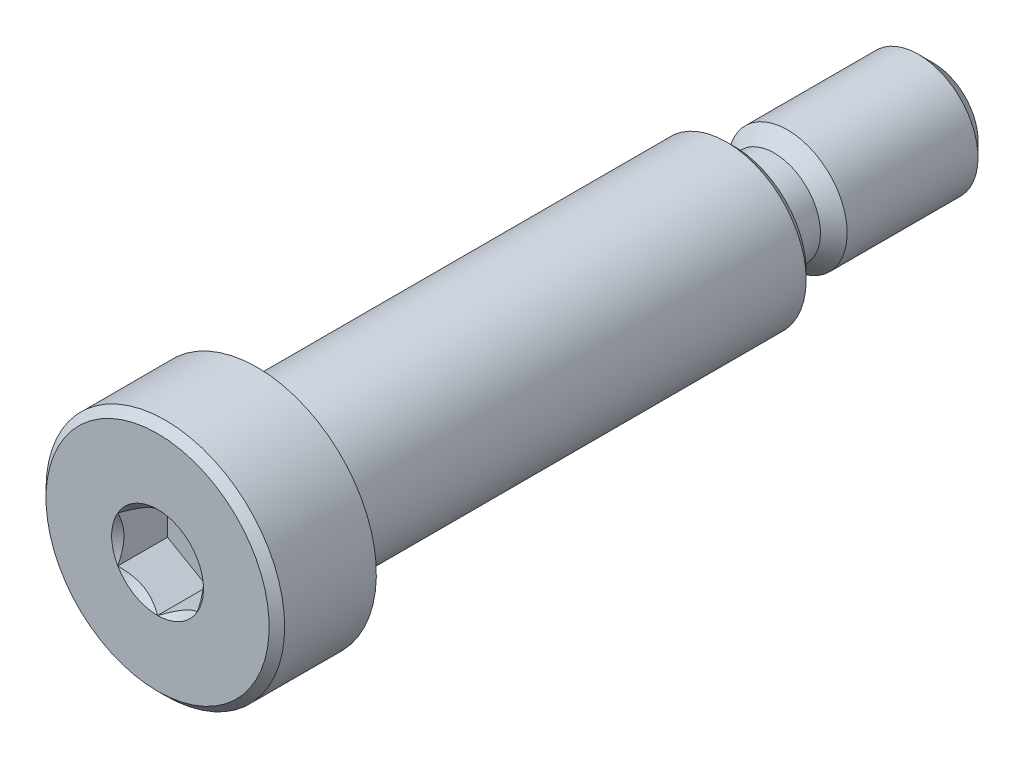
ISO-10303-21;
HEADER;
FILE_DESCRIPTION(('STEP AP214'),'2;1');
FILE_NAME('part.step','',(''),(''),'','','');
FILE_SCHEMA(('AUTOMOTIVE_DESIGN { 1 0 10303 214 1 1 1 1 }'));
ENDSEC;
DATA;
#1=APPLICATION_CONTEXT('core data for automotive mechanical design processes');
#2=APPLICATION_PROTOCOL_DEFINITION('international standard','automotive_design',2000,#1);
#3=PRODUCT_CONTEXT('',#1,'mechanical');
#4=PRODUCT('Part','Part','',(#3));
#5=PRODUCT_RELATED_PRODUCT_CATEGORY('part','',(#4));
#6=PRODUCT_DEFINITION_FORMATION('','',#4);
#7=PRODUCT_DEFINITION_CONTEXT('part definition',#1,'design');
#8=PRODUCT_DEFINITION('design','',#6,#7);
#9=PRODUCT_DEFINITION_SHAPE('','',#8);
#10=(LENGTH_UNIT() NAMED_UNIT(*) SI_UNIT(.MILLI.,.METRE.));
#11=(NAMED_UNIT(*) PLANE_ANGLE_UNIT() SI_UNIT($,.RADIAN.));
#12=(NAMED_UNIT(*) SI_UNIT($,.STERADIAN.) SOLID_ANGLE_UNIT());
#13=UNCERTAINTY_MEASURE_WITH_UNIT(LENGTH_MEASURE(1.E-05),#10,'distance_accuracy_value','');
#14=(GEOMETRIC_REPRESENTATION_CONTEXT(3) GLOBAL_UNCERTAINTY_ASSIGNED_CONTEXT((#13)) GLOBAL_UNIT_ASSIGNED_CONTEXT((#10,
#11,#12)) REPRESENTATION_CONTEXT('',''));
#15=CARTESIAN_POINT('',(0.,0.,0.));
#16=DIRECTION('',(0.,0.,1.));
#17=DIRECTION('',(1.,0.,0.));
#18=AXIS2_PLACEMENT_3D('',#15,#16,#17);
#19=CARTESIAN_POINT('',(0.,0.,0.));
#20=DIRECTION('',(0.,0.,1.));
#21=DIRECTION('',(0.,-1.,0.));
#22=AXIS2_PLACEMENT_3D('',#19,#20,#21);
#23=PLANE('',#22);
#24=CARTESIAN_POINT('',(0.,0.,0.));
#25=DIRECTION('',(0.,0.,1.));
#26=DIRECTION('',(1.,0.,0.));
#27=AXIS2_PLACEMENT_3D('',#24,#25,#26);
#28=CIRCLE('',#27,3.66617420935412);
#29=CARTESIAN_POINT('',(0.,-3.66617420935412,0.));
#30=VERTEX_POINT('',#29);
#31=CARTESIAN_POINT('',(3.175,-1.83308710467707,0.));
#32=VERTEX_POINT('',#31);
#33=EDGE_CURVE('E54',#30,#32,#28,.T.);
#34=ORIENTED_EDGE('',*,*,#33,.F.);
#35=CARTESIAN_POINT('',(-3.175,-1.83308710467706,0.));
#36=VERTEX_POINT('',#35);
#37=EDGE_CURVE('E61',#36,#30,#28,.T.);
#38=ORIENTED_EDGE('',*,*,#37,.F.);
#39=CARTESIAN_POINT('',(-3.175,1.83308710467706,0.));
#40=VERTEX_POINT('',#39);
#41=EDGE_CURVE('E134',#40,#36,#28,.T.);
#42=ORIENTED_EDGE('',*,*,#41,.F.);
#43=CARTESIAN_POINT('',(0.,3.66617420935412,0.));
#44=VERTEX_POINT('',#43);
#45=EDGE_CURVE('E129',#44,#40,#28,.T.);
#46=ORIENTED_EDGE('',*,*,#45,.F.);
#47=CARTESIAN_POINT('',(3.175,1.83308710467706,0.));
#48=VERTEX_POINT('',#47);
#49=EDGE_CURVE('E102',#48,#44,#28,.T.);
#50=ORIENTED_EDGE('',*,*,#49,.F.);
#51=EDGE_CURVE('E93',#32,#48,#28,.T.);
#52=ORIENTED_EDGE('',*,*,#51,.F.);
#53=EDGE_LOOP('',(#34,#38,#42,#46,#50,#52));
#54=FACE_BOUND('',#53,.T.);
#55=CARTESIAN_POINT('',(0.,0.,0.));
#56=DIRECTION('',(0.,0.,1.));
#57=DIRECTION('',(0.,-1.,0.));
#58=AXIS2_PLACEMENT_3D('',#55,#56,#57);
#59=CIRCLE('',#58,8.90587499999999);
#60=CARTESIAN_POINT('',(0.,-8.90587499999999,0.));
#61=VERTEX_POINT('',#60);
#62=EDGE_CURVE('E48',#61,#61,#59,.T.);
#63=ORIENTED_EDGE('',*,*,#62,.T.);
#64=EDGE_LOOP('',(#63));
#65=FACE_BOUND('',#64,.T.);
#66=ADVANCED_FACE('F34',(#54,#65),#23,.T.);
#67=CARTESIAN_POINT('',(0.,0.,-61.9125));
#68=DIRECTION('',(0.,0.,-1.));
#69=DIRECTION('',(0.,1.,0.));
#70=AXIS2_PLACEMENT_3D('',#67,#68,#69);
#71=CYLINDRICAL_SURFACE('',#70,9.525);
#72=CARTESIAN_POINT('',(0.,0.,-0.619125000000019));
#73=DIRECTION('',(0.,0.,1.));
#74=DIRECTION('',(0.,-1.,0.));
#75=AXIS2_PLACEMENT_3D('',#72,#73,#74);
#76=CIRCLE('',#75,9.525);
#77=CARTESIAN_POINT('',(0.,-9.525,-0.619125000000019));
#78=VERTEX_POINT('',#77);
#79=EDGE_CURVE('E226',#78,#78,#76,.F.);
#80=ORIENTED_EDGE('',*,*,#79,.T.);
#81=EDGE_LOOP('',(#80));
#82=FACE_BOUND('',#81,.T.);
#83=CARTESIAN_POINT('',(0.,0.,-7.93750000000001));
#84=DIRECTION('',(0.,0.,-1.));
#85=DIRECTION('',(0.,1.,0.));
#86=AXIS2_PLACEMENT_3D('',#83,#84,#85);
#87=CIRCLE('',#86,9.525);
#88=CARTESIAN_POINT('',(0.,9.525,-7.93750000000001));
#89=VERTEX_POINT('',#88);
#90=EDGE_CURVE('E241',#89,#89,#87,.T.);
#91=ORIENTED_EDGE('',*,*,#90,.F.);
#92=EDGE_LOOP('',(#91));
#93=FACE_BOUND('',#92,.T.);
#94=ADVANCED_FACE('F195',(#82,#93),#71,.T.);
#95=CARTESIAN_POINT('',(0.,-9.525,-7.93750000000001));
#96=DIRECTION('',(0.,0.,-1.));
#97=DIRECTION('',(0.,1.,0.));
#98=AXIS2_PLACEMENT_3D('',#95,#96,#97);
#99=PLANE('',#98);
#100=ORIENTED_EDGE('',*,*,#90,.T.);
#101=EDGE_LOOP('',(#100));
#102=FACE_BOUND('',#101,.T.);
#103=CARTESIAN_POINT('',(0.,0.,-7.93750000000001));
#104=DIRECTION('',(0.,0.,-1.));
#105=DIRECTION('',(0.,1.,0.));
#106=AXIS2_PLACEMENT_3D('',#103,#104,#105);
#107=CIRCLE('',#106,6.34999999999999);
#108=CARTESIAN_POINT('',(0.,6.34999999999999,-7.93750000000001));
#109=VERTEX_POINT('',#108);
#110=EDGE_CURVE('E243',#109,#109,#107,.T.);
#111=ORIENTED_EDGE('',*,*,#110,.F.);
#112=EDGE_LOOP('',(#111));
#113=FACE_BOUND('',#112,.T.);
#114=ADVANCED_FACE('F200',(#102,#113),#99,.T.);
#115=CARTESIAN_POINT('',(0.,0.,-61.9125));
#116=DIRECTION('',(0.,0.,-1.));
#117=DIRECTION('',(0.,1.,0.));
#118=AXIS2_PLACEMENT_3D('',#115,#116,#117);
#119=CYLINDRICAL_SURFACE('',#118,6.35);
#120=CARTESIAN_POINT('',(0.,0.,-45.418375));
#121=DIRECTION('',(0.,0.,-1.));
#122=DIRECTION('',(0.,1.,0.));
#123=AXIS2_PLACEMENT_3D('',#120,#121,#122);
#124=CIRCLE('',#123,6.35);
#125=CARTESIAN_POINT('',(0.,-6.34999999999999,-45.418375));
#126=VERTEX_POINT('',#125);
#127=EDGE_CURVE('E219',#126,#126,#124,.F.);
#128=ORIENTED_EDGE('',*,*,#127,.T.);
#129=EDGE_LOOP('',(#128));
#130=FACE_BOUND('',#129,.T.);
#131=ORIENTED_EDGE('',*,*,#110,.T.);
#132=EDGE_LOOP('',(#131));
#133=FACE_BOUND('',#132,.T.);
#134=ADVANCED_FACE('F344',(#130,#133),#119,.T.);
#135=CARTESIAN_POINT('',(0.,-6.35,-46.0375));
#136=DIRECTION('',(0.,0.,-1.));
#137=DIRECTION('',(0.,1.,0.));
#138=AXIS2_PLACEMENT_3D('',#135,#136,#137);
#139=PLANE('',#138);
#140=CARTESIAN_POINT('',(0.,0.,-46.0375));
#141=DIRECTION('',(0.,0.,-1.));
#142=DIRECTION('',(0.,1.,0.));
#143=AXIS2_PLACEMENT_3D('',#140,#141,#142);
#144=CIRCLE('',#143,5.73087499999999);
#145=CARTESIAN_POINT('',(0.,-5.73087499999998,-46.0375));
#146=VERTEX_POINT('',#145);
#147=EDGE_CURVE('E222',#146,#146,#144,.T.);
#148=ORIENTED_EDGE('',*,*,#147,.T.);
#149=EDGE_LOOP('',(#148));
#150=FACE_BOUND('',#149,.T.);
#151=CARTESIAN_POINT('',(0.,0.,-46.0375));
#152=DIRECTION('',(0.,0.,-1.));
#153=DIRECTION('',(0.,1.,0.));
#154=AXIS2_PLACEMENT_3D('',#151,#152,#153);
#155=CIRCLE('',#154,4.7625);
#156=CARTESIAN_POINT('',(0.,4.7625,-46.0375));
#157=VERTEX_POINT('',#156);
#158=EDGE_CURVE('E252',#157,#157,#155,.T.);
#159=ORIENTED_EDGE('',*,*,#158,.F.);
#160=EDGE_LOOP('',(#159));
#161=FACE_BOUND('',#160,.T.);
#162=ADVANCED_FACE('F351',(#150,#161),#139,.T.);
#163=CARTESIAN_POINT('',(0.,0.,-47.1043));
#164=DIRECTION('',(0.,0.,-1.));
#165=DIRECTION('',(0.,1.,0.));
#166=AXIS2_PLACEMENT_3D('',#163,#164,#165);
#167=TOROIDAL_SURFACE('',#166,4.7625,1.0668);
#168=CARTESIAN_POINT('',(0.,0.,-47.1043));
#169=DIRECTION('',(0.,0.,-1.));
#170=DIRECTION('',(0.,1.,0.));
#171=AXIS2_PLACEMENT_3D('',#168,#169,#170);
#172=CIRCLE('',#171,3.6957);
#173=CARTESIAN_POINT('',(0.,3.6957,-47.1043));
#174=VERTEX_POINT('',#173);
#175=EDGE_CURVE('E256',#174,#174,#172,.T.);
#176=ORIENTED_EDGE('',*,*,#175,.F.);
#177=EDGE_LOOP('',(#176));
#178=FACE_BOUND('',#177,.T.);
#179=ORIENTED_EDGE('',*,*,#158,.T.);
#180=EDGE_LOOP('',(#179));
#181=FACE_BOUND('',#180,.T.);
#182=ADVANCED_FACE('F359',(#178,#181),#167,.F.);
#183=CARTESIAN_POINT('',(0.,0.,-61.9125));
#184=DIRECTION('',(0.,0.,-1.));
#185=DIRECTION('',(0.,1.,0.));
#186=AXIS2_PLACEMENT_3D('',#183,#184,#185);
#187=CYLINDRICAL_SURFACE('',#186,3.6957);
#188=CARTESIAN_POINT('',(0.,0.,-49.2125));
#189=DIRECTION('',(0.,0.,-1.));
#190=DIRECTION('',(0.,1.,0.));
#191=AXIS2_PLACEMENT_3D('',#188,#189,#190);
#192=CIRCLE('',#191,3.6957);
#193=CARTESIAN_POINT('',(0.,3.6957,-49.2125));
#194=VERTEX_POINT('',#193);
#195=EDGE_CURVE('E260',#194,#194,#192,.T.);
#196=ORIENTED_EDGE('',*,*,#195,.F.);
#197=EDGE_LOOP('',(#196));
#198=FACE_BOUND('',#197,.T.);
#199=ORIENTED_EDGE('',*,*,#175,.T.);
#200=EDGE_LOOP('',(#199));
#201=FACE_BOUND('',#200,.T.);
#202=ADVANCED_FACE('F385',(#198,#201),#187,.T.);
#203=CARTESIAN_POINT('',(0.,0.,-49.2125));
#204=DIRECTION('',(0.,0.,-1.));
#205=DIRECTION('',(0.,1.,0.));
#206=AXIS2_PLACEMENT_3D('',#203,#204,#205);
#207=CONICAL_SURFACE('',#206,3.6957,0.785398163397443);
#208=CARTESIAN_POINT('',(0.,0.,-50.2793));
#209=DIRECTION('',(0.,0.,-1.));
#210=DIRECTION('',(0.,1.,0.));
#211=AXIS2_PLACEMENT_3D('',#208,#209,#210);
#212=CIRCLE('',#211,4.7625);
#213=CARTESIAN_POINT('',(0.,4.7625,-50.2793));
#214=VERTEX_POINT('',#213);
#215=EDGE_CURVE('E247',#214,#214,#212,.F.);
#216=ORIENTED_EDGE('',*,*,#215,.T.);
#217=EDGE_LOOP('',(#216));
#218=FACE_BOUND('',#217,.T.);
#219=ORIENTED_EDGE('',*,*,#195,.T.);
#220=EDGE_LOOP('',(#219));
#221=FACE_BOUND('',#220,.T.);
#222=ADVANCED_FACE('F376',(#218,#221),#207,.T.);
#223=CARTESIAN_POINT('',(0.,-4.7625,-61.9125));
#224=DIRECTION('',(0.,0.,-1.));
#225=DIRECTION('',(0.,1.,0.));
#226=AXIS2_PLACEMENT_3D('',#223,#224,#225);
#227=PLANE('',#226);
#228=CARTESIAN_POINT('',(0.,0.,-61.9125));
#229=DIRECTION('',(0.,0.,-1.));
#230=DIRECTION('',(0.,1.,0.));
#231=AXIS2_PLACEMENT_3D('',#228,#229,#230);
#232=CIRCLE('',#231,3.57187500000002);
#233=CARTESIAN_POINT('',(0.,3.57187500000002,-61.9125));
#234=VERTEX_POINT('',#233);
#235=EDGE_CURVE('E229',#234,#234,#232,.T.);
#236=ORIENTED_EDGE('',*,*,#235,.T.);
#237=EDGE_LOOP('',(#236));
#238=FACE_BOUND('',#237,.T.);
#239=ADVANCED_FACE('F367',(#238),#227,.T.);
#240=CARTESIAN_POINT('',(0.,0.,-61.9125));
#241=DIRECTION('',(0.,0.,-1.));
#242=DIRECTION('',(0.,1.,0.));
#243=AXIS2_PLACEMENT_3D('',#240,#241,#242);
#244=CYLINDRICAL_SURFACE('',#243,4.7625);
#245=CARTESIAN_POINT('',(0.,0.,-60.721875));
#246=DIRECTION('',(0.,0.,-1.));
#247=DIRECTION('',(0.,1.,0.));
#248=AXIS2_PLACEMENT_3D('',#245,#246,#247);
#249=CIRCLE('',#248,4.7625);
#250=CARTESIAN_POINT('',(0.,4.7625,-60.721875));
#251=VERTEX_POINT('',#250);
#252=EDGE_CURVE('E224',#251,#251,#249,.F.);
#253=ORIENTED_EDGE('',*,*,#252,.T.);
#254=EDGE_LOOP('',(#253));
#255=FACE_BOUND('',#254,.T.);
#256=ORIENTED_EDGE('',*,*,#215,.F.);
#257=EDGE_LOOP('',(#256));
#258=FACE_BOUND('',#257,.T.);
#259=ADVANCED_FACE('F208',(#255,#258),#244,.T.);
#260=CARTESIAN_POINT('',(0.,0.,-61.9125));
#261=DIRECTION('',(0.,0.,1.));
#262=DIRECTION('',(0.,-1.,0.));
#263=AXIS2_PLACEMENT_3D('',#260,#261,#262);
#264=CONICAL_SURFACE('',#263,3.57187500000002,0.785398163397442);
#265=ORIENTED_EDGE('',*,*,#252,.F.);
#266=EDGE_LOOP('',(#265));
#267=FACE_BOUND('',#266,.T.);
#268=ORIENTED_EDGE('',*,*,#235,.F.);
#269=EDGE_LOOP('',(#268));
#270=FACE_BOUND('',#269,.T.);
#271=ADVANCED_FACE('F205',(#267,#270),#264,.T.);
#272=CARTESIAN_POINT('',(0.,0.,-46.0375));
#273=DIRECTION('',(0.,0.,1.));
#274=DIRECTION('',(0.,-1.,0.));
#275=AXIS2_PLACEMENT_3D('',#272,#273,#274);
#276=CONICAL_SURFACE('',#275,5.73087499999999,0.78539816339745);
#277=CARTESIAN_POINT('',(0.,-6.34999999999999,-45.418375));
#278=CARTESIAN_POINT('',(0.,-6.34355078124999,-45.42482421875));
#279=CARTESIAN_POINT('',(0.,-6.33710156249999,-45.4312734375));
#280=CARTESIAN_POINT('',(0.,-6.32420312499999,-45.444171875));
#281=CARTESIAN_POINT('',(0.,-6.31775390624999,-45.45062109375));
#282=CARTESIAN_POINT('',(0.,-6.30485546874999,-45.46351953125));
#283=CARTESIAN_POINT('',(0.,-6.29840624999999,-45.46996875));
#284=CARTESIAN_POINT('',(0.,-6.28550781249999,-45.4828671875));
#285=CARTESIAN_POINT('',(0.,-6.27905859374999,-45.48931640625));
#286=CARTESIAN_POINT('',(0.,-6.26616015624999,-45.50221484375));
#287=CARTESIAN_POINT('',(0.,-6.25971093749999,-45.5086640625));
#288=CARTESIAN_POINT('',(0.,-6.24681249999999,-45.5215625));
#289=CARTESIAN_POINT('',(0.,-6.24036328124999,-45.52801171875));
#290=CARTESIAN_POINT('',(0.,-6.22746484374999,-45.54091015625));
#291=CARTESIAN_POINT('',(0.,-6.22101562499999,-45.547359375));
#292=CARTESIAN_POINT('',(0.,-6.20811718749999,-45.5602578125));
#293=CARTESIAN_POINT('',(0.,-6.20166796874999,-45.56670703125));
#294=CARTESIAN_POINT('',(0.,-6.18876953124999,-45.57960546875));
#295=CARTESIAN_POINT('',(0.,-6.18232031249999,-45.5860546875));
#296=CARTESIAN_POINT('',(0.,-6.16942187499999,-45.598953125));
#297=CARTESIAN_POINT('',(0.,-6.16297265624999,-45.60540234375));
#298=CARTESIAN_POINT('',(0.,-6.15007421874999,-45.61830078125));
#299=CARTESIAN_POINT('',(0.,-6.14362499999999,-45.62475));
#300=CARTESIAN_POINT('',(0.,-6.13072656249999,-45.6376484375));
#301=CARTESIAN_POINT('',(0.,-6.12427734374999,-45.64409765625));
#302=CARTESIAN_POINT('',(0.,-6.11137890624999,-45.65699609375));
#303=CARTESIAN_POINT('',(0.,-6.10492968749999,-45.6634453125));
#304=CARTESIAN_POINT('',(0.,-6.09203124999999,-45.67634375));
#305=CARTESIAN_POINT('',(0.,-6.08558203124999,-45.68279296875));
#306=CARTESIAN_POINT('',(0.,-6.07268359374999,-45.69569140625));
#307=CARTESIAN_POINT('',(0.,-6.06623437499999,-45.702140625));
#308=CARTESIAN_POINT('',(0.,-6.05333593749999,-45.7150390625));
#309=CARTESIAN_POINT('',(0.,-6.04688671874999,-45.72148828125));
#310=CARTESIAN_POINT('',(0.,-6.03398828124999,-45.73438671875));
#311=CARTESIAN_POINT('',(0.,-6.02753906249999,-45.7408359375));
#312=CARTESIAN_POINT('',(0.,-6.01464062499999,-45.753734375));
#313=CARTESIAN_POINT('',(0.,-6.00819140624999,-45.76018359375));
#314=CARTESIAN_POINT('',(0.,-5.99529296874999,-45.77308203125));
#315=CARTESIAN_POINT('',(0.,-5.98884374999998,-45.77953125));
#316=CARTESIAN_POINT('',(0.,-5.97594531249998,-45.7924296875));
#317=CARTESIAN_POINT('',(0.,-5.96949609374999,-45.79887890625));
#318=CARTESIAN_POINT('',(0.,-5.95659765624999,-45.81177734375));
#319=CARTESIAN_POINT('',(0.,-5.95014843749999,-45.8182265625));
#320=CARTESIAN_POINT('',(0.,-5.93724999999999,-45.831125));
#321=CARTESIAN_POINT('',(0.,-5.93080078124999,-45.83757421875));
#322=CARTESIAN_POINT('',(0.,-5.91790234374998,-45.85047265625));
#323=CARTESIAN_POINT('',(0.,-5.91145312499998,-45.856921875));
#324=CARTESIAN_POINT('',(0.,-5.89855468749998,-45.8698203125));
#325=CARTESIAN_POINT('',(0.,-5.89210546874998,-45.87626953125));
#326=CARTESIAN_POINT('',(0.,-5.87920703124998,-45.88916796875));
#327=CARTESIAN_POINT('',(0.,-5.87275781249998,-45.8956171875));
#328=CARTESIAN_POINT('',(0.,-5.85985937499998,-45.908515625));
#329=CARTESIAN_POINT('',(0.,-5.85341015624998,-45.91496484375));
#330=CARTESIAN_POINT('',(0.,-5.84051171874998,-45.92786328125));
#331=CARTESIAN_POINT('',(0.,-5.83406249999998,-45.9343125));
#332=CARTESIAN_POINT('',(0.,-5.82116406249998,-45.9472109375));
#333=CARTESIAN_POINT('',(0.,-5.81471484374998,-45.95366015625));
#334=CARTESIAN_POINT('',(0.,-5.80181640624998,-45.96655859375));
#335=CARTESIAN_POINT('',(0.,-5.79536718749998,-45.9730078125));
#336=CARTESIAN_POINT('',(0.,-5.78246874999998,-45.98590625));
#337=CARTESIAN_POINT('',(0.,-5.77601953124998,-45.99235546875));
#338=CARTESIAN_POINT('',(0.,-5.76312109374998,-46.00525390625));
#339=CARTESIAN_POINT('',(0.,-5.75667187499998,-46.011703125));
#340=CARTESIAN_POINT('',(0.,-5.74377343749998,-46.0246015625));
#341=CARTESIAN_POINT('',(0.,-5.73732421874998,-46.03105078125));
#342=CARTESIAN_POINT('',(0.,-5.73087499999998,-46.0375));
#343=B_SPLINE_CURVE_WITH_KNOTS('',3,(#277,#278,#279,#280,#281,#282,#283,#284,#285,#286,#287,
#288,#289,#290,#291,#292,#293,#294,#295,#296,#297,#298,#299,#300,#301,#302,#303,#304,#305,#306,
#307,#308,#309,#310,#311,#312,#313,#314,#315,#316,#317,#318,#319,#320,#321,#322,#323,#324,#325,
#326,#327,#328,#329,#330,#331,#332,#333,#334,#335,#336,#337,#338,#339,#340,#341,#342),
.UNSPECIFIED.,.F.,.F.,(4,2,2,2,2,2,2,2,2,2,2,2,2,2,2,2,2,2,2,2,2,2,2,2,2,2,2,2,2,2,2,2,4),(0.,
0.0273617178688837,0.0547234357377674,0.0820851536066518,0.109446871475536,0.136808589344414,
0.164170307213299,0.191532025082182,0.218893742951066,0.24625546081995,0.273617178688829,
0.300978896557713,0.328340614426597,0.355702332295481,0.38306405016436,0.410425768033244,
0.437787485902128,0.465149203771012,0.492510921639895,0.519872639508775,0.547234357377659,
0.574596075246542,0.601957793115427,0.629319510984305,0.656681228853189,0.684042946722074,
0.711404664590957,0.738766382459841,0.76612810032872,0.793489818197604,0.820851536066488,
0.848213253935372,0.875574971804251),.UNSPECIFIED.);
#344=EDGE_CURVE('BSEAM207',#126,#146,#343,.T.);
#345=ORIENTED_EDGE('',*,*,#127,.F.);
#346=ORIENTED_EDGE('',*,*,#147,.F.);
#347=ORIENTED_EDGE('',*,*,#344,.T.);
#348=ORIENTED_EDGE('',*,*,#344,.F.);
#349=EDGE_LOOP('',(#345,#347,#346,#348));
#350=FACE_BOUND('',#349,.T.);
#351=ADVANCED_FACE('F207',(#350),#276,.T.);
#352=CARTESIAN_POINT('',(0.,0.,-0.619125000000019));
#353=DIRECTION('',(0.,0.,-1.));
#354=DIRECTION('',(0.,1.,0.));
#355=AXIS2_PLACEMENT_3D('',#352,#353,#354);
#356=CONICAL_SURFACE('',#355,9.525,0.785398163397443);
#357=ORIENTED_EDGE('',*,*,#62,.F.);
#358=EDGE_LOOP('',(#357));
#359=FACE_BOUND('',#358,.T.);
#360=ORIENTED_EDGE('',*,*,#79,.F.);
#361=EDGE_LOOP('',(#360));
#362=FACE_BOUND('',#361,.T.);
#363=ADVANCED_FACE('F36',(#359,#362),#356,.T.);
#364=CARTESIAN_POINT('',(0.,0.,0.));
#365=DIRECTION('',(0.,0.,1.));
#366=DIRECTION('',(1.,0.,0.));
#367=AXIS2_PLACEMENT_3D('',#364,#365,#366);
#368=CONICAL_SURFACE('',#367,3.66617420935412,0.78539816339745);
#369=ORIENTED_EDGE('',*,*,#49,.T.);
#370=CARTESIAN_POINT('',(3.1752,1.83297163462322,0.000115475508944067));
#371=CARTESIAN_POINT('',(3.06606165005017,1.89598269034567,-0.0628410163082169));
#372=CARTESIAN_POINT('',(2.95509837192206,1.9600473688431,-0.122099895765255));
#373=CARTESIAN_POINT('',(2.72883215365405,2.09068223086865,-0.230601344269443));
#374=CARTESIAN_POINT('',(2.61350769674774,2.15726483710766,-0.279783546061288));
#375=CARTESIAN_POINT('',(2.38096147751938,2.29152545937818,-0.364033541125997));
#376=CARTESIAN_POINT('',(2.26379893371885,2.35916928558036,-0.399313085500551));
#377=CARTESIAN_POINT('',(2.02689455535372,2.49594609220167,-0.45366842986518));
#378=CARTESIAN_POINT('',(1.90715995735645,2.5650748945867,-0.47278480247036));
#379=CARTESIAN_POINT('',(1.70080208124842,2.68421566990707,-0.490032869376752));
#380=CARTESIAN_POINT('',(1.61444529227085,2.73407378526963,-0.492586066386179));
#381=CARTESIAN_POINT('',(1.44187218347529,2.83370891608763,-0.488283726876735));
#382=CARTESIAN_POINT('',(1.3556559235072,2.88348589698873,-0.481424891978556));
#383=CARTESIAN_POINT('',(1.18404020841287,2.98256827629561,-0.4586901166963));
#384=CARTESIAN_POINT('',(1.09864177574673,3.03187308438378,-0.442804090312722));
#385=CARTESIAN_POINT('',(0.929311596694528,3.1296359088415,-0.402882016002049));
#386=CARTESIAN_POINT('',(0.845379738380253,3.17809398983283,-0.37884659291483));
#387=CARTESIAN_POINT('',(0.696376420715886,3.2641210953965,-0.329394765582835));
#388=CARTESIAN_POINT('',(0.630975148808269,3.30188053733771,-0.305278280699013));
#389=CARTESIAN_POINT('',(0.501346749794894,3.3767215284027,-0.253158532862845));
#390=CARTESIAN_POINT('',(0.437119658558277,3.41380305681743,-0.225155151396475));
#391=CARTESIAN_POINT('',(0.3100419654874,3.48717139711989,-0.165889434455491));
#392=CARTESIAN_POINT('',(0.247187749251276,3.52346029578352,-0.134637346645791));
#393=CARTESIAN_POINT('',(0.122643379151907,3.59536602138644,-0.0692846556080675));
#394=CARTESIAN_POINT('',(0.0609525390212909,3.63098324454239,-0.0351858004814551));
#395=CARTESIAN_POINT('',(-0.000199999999999575,3.66628967940796,0.000115475508943787));
#396=B_SPLINE_CURVE_WITH_KNOTS('',3,(#370,#371,#372,#373,#374,#375,#376,#377,#378,#379,#380,
#381,#382,#383,#384,#385,#386,#387,#388,#389,#390,#391,#392,#393,#394,#395),.UNSPECIFIED.,.F.,
.F.,(4,2,2,2,2,2,2,2,2,2,2,2,4),(0.,0.422910572436808,0.848285055427807,1.26690402276127,
1.68446903107506,1.98329272958351,2.2822211754689,2.58148426995465,2.88072442418452,
3.11844134429546,3.35616551414405,3.59316134346767,3.8300126974443),.UNSPECIFIED.);
#397=EDGE_CURVE('E11',#48,#44,#396,.T.);
#398=ORIENTED_EDGE('',*,*,#397,.F.);
#399=EDGE_LOOP('',(#369,#398));
#400=FACE_BOUND('',#399,.T.);
#401=ADVANCED_FACE('F105',(#400),#368,.F.);
#402=ORIENTED_EDGE('',*,*,#45,.T.);
#403=CARTESIAN_POINT('',(0.000200000000000467,3.66628967940796,0.000115475508943935));
#404=CARTESIAN_POINT('',(-0.108938349949825,3.60327862368552,-0.0628410163082174));
#405=CARTESIAN_POINT('',(-0.219901628077944,3.53921394518809,-0.122099895765256));
#406=CARTESIAN_POINT('',(-0.446167846345946,3.40857908316254,-0.230601344269443));
#407=CARTESIAN_POINT('',(-0.561492303252261,3.34199647692353,-0.279783546061287));
#408=CARTESIAN_POINT('',(-0.794038522480624,3.207735854653,-0.364033541125996));
#409=CARTESIAN_POINT('',(-0.911201066281148,3.14009202845083,-0.39931308550055));
#410=CARTESIAN_POINT('',(-1.14810544464628,3.00331522182952,-0.453668429865179));
#411=CARTESIAN_POINT('',(-1.26784004264355,2.93418641944448,-0.47278480247036));
#412=CARTESIAN_POINT('',(-1.47419791875158,2.81504564412411,-0.490032869376752));
#413=CARTESIAN_POINT('',(-1.56055470772915,2.76518752876156,-0.492586066386179));
#414=CARTESIAN_POINT('',(-1.73312781652471,2.66555239794355,-0.488283726876735));
#415=CARTESIAN_POINT('',(-1.8193440764928,2.61577541704245,-0.481424891978555));
#416=CARTESIAN_POINT('',(-1.99095979158713,2.51669303773558,-0.458690116696299));
#417=CARTESIAN_POINT('',(-2.07635822425327,2.4673882296474,-0.442804090312722));
#418=CARTESIAN_POINT('',(-2.24568840330547,2.36962540518969,-0.402882016002048));
#419=CARTESIAN_POINT('',(-2.32962026161975,2.32116732419836,-0.37884659291483));
#420=CARTESIAN_POINT('',(-2.47862357928411,2.23514021863469,-0.329394765582835));
#421=CARTESIAN_POINT('',(-2.54402485119173,2.19738077669348,-0.305278280699012));
#422=CARTESIAN_POINT('',(-2.67365325020511,2.12253978562849,-0.253158532862845));
#423=CARTESIAN_POINT('',(-2.73788034144172,2.08545825721376,-0.225155151396475));
#424=CARTESIAN_POINT('',(-2.8649580345126,2.01208991691129,-0.165889434455491));
#425=CARTESIAN_POINT('',(-2.92781225074872,1.97580101824767,-0.134637346645791));
#426=CARTESIAN_POINT('',(-3.05235662084809,1.90389529264474,-0.0692846556080678));
#427=CARTESIAN_POINT('',(-3.11404746097871,1.8682780694888,-0.0351858004814554));
#428=CARTESIAN_POINT('',(-3.1752,1.83297163462323,0.000115475508943606));
#429=B_SPLINE_CURVE_WITH_KNOTS('',3,(#403,#404,#405,#406,#407,#408,#409,#410,#411,#412,#413,
#414,#415,#416,#417,#418,#419,#420,#421,#422,#423,#424,#425,#426,#427,#428),.UNSPECIFIED.,.F.,
.F.,(4,2,2,2,2,2,2,2,2,2,2,2,4),(0.,0.422910572436808,0.848285055427807,1.26690402276127,
1.68446903107506,1.98329272958351,2.2822211754689,2.58148426995465,2.88072442418451,
3.11844134429546,3.35616551414405,3.59316134346766,3.8300126974443),.UNSPECIFIED.);
#430=EDGE_CURVE('E130',#44,#40,#429,.T.);
#431=ORIENTED_EDGE('',*,*,#430,.F.);
#432=EDGE_LOOP('',(#402,#431));
#433=FACE_BOUND('',#432,.T.);
#434=ADVANCED_FACE('F297',(#433),#368,.F.);
#435=ORIENTED_EDGE('',*,*,#41,.T.);
#436=CARTESIAN_POINT('',(-3.175,-3.65592387452516,1.17597452610651));
#437=CARTESIAN_POINT('',(-3.175,-3.56690614739902,1.10877955728795));
#438=CARTESIAN_POINT('',(-3.175,-3.47739001482927,1.04223411677949));
#439=CARTESIAN_POINT('',(-3.175,-3.29716433407819,0.910733107989));
#440=CARTESIAN_POINT('',(-3.175,-3.20645449195236,0.8457779430093));
#441=CARTESIAN_POINT('',(-3.175,-3.02298124672425,0.717286472588262));
#442=CARTESIAN_POINT('',(-3.175,-2.93020737789476,0.653765060519482));
#443=CARTESIAN_POINT('',(-3.175,-2.74308490461527,0.529093231239513));
#444=CARTESIAN_POINT('',(-3.175,-2.64873641209623,0.467942646518007));
#445=CARTESIAN_POINT('',(-3.175,-2.45276910629102,0.345127291468585));
#446=CARTESIAN_POINT('',(-3.175,-2.35104296923552,0.283632900035067));
#447=CARTESIAN_POINT('',(-3.175,-2.14521620329061,0.164690024110211));
#448=CARTESIAN_POINT('',(-3.175,-2.04111520164361,0.107242180628362));
#449=CARTESIAN_POINT('',(-3.175,-1.8305483898592,-0.00236807378855735));
#450=CARTESIAN_POINT('',(-3.175,-1.72409073387149,-0.05454602658689));
#451=CARTESIAN_POINT('',(-3.175,-1.50827203793058,-0.152448430174923));
#452=CARTESIAN_POINT('',(-3.175,-1.39891233941784,-0.198175803007057));
#453=CARTESIAN_POINT('',(-3.175,-1.18604701054559,-0.278193824629251));
#454=CARTESIAN_POINT('',(-3.175,-1.08277848917347,-0.313108695034414));
#455=CARTESIAN_POINT('',(-3.175,-0.873755153890324,-0.374653665073786));
#456=CARTESIAN_POINT('',(-3.175,-0.768000169236097,-0.401283193963396));
#457=CARTESIAN_POINT('',(-3.175,-0.556394353071963,-0.444423804951883));
#458=CARTESIAN_POINT('',(-3.175,-0.450579451492892,-0.461108250420231));
#459=CARTESIAN_POINT('',(-3.175,-0.237818454981045,-0.484034858218018));
#460=CARTESIAN_POINT('',(-3.175,-0.130872557680108,-0.49027881555587));
#461=CARTESIAN_POINT('',(-3.175,0.0792250150830045,-0.491860727197653));
#462=CARTESIAN_POINT('',(-3.175,0.18237391199382,-0.487585251998013));
#463=CARTESIAN_POINT('',(-3.175,0.387788153537299,-0.469217325011947));
#464=CARTESIAN_POINT('',(-3.175,0.490053411359905,-0.455123919552885));
#465=CARTESIAN_POINT('',(-3.175,0.694689208906974,-0.417649304806497));
#466=CARTESIAN_POINT('',(-3.175,0.797030337701614,-0.394110040645698));
#467=CARTESIAN_POINT('',(-3.175,0.999482692253839,-0.3389990990408));
#468=CARTESIAN_POINT('',(-3.175,1.09959410383402,-0.307428093699382));
#469=CARTESIAN_POINT('',(-3.175,1.30666025401972,-0.234302973381313));
#470=CARTESIAN_POINT('',(-3.175,1.41338058113121,-0.192091761298271));
#471=CARTESIAN_POINT('',(-3.175,1.62403512608011,-0.101194633675295));
#472=CARTESIAN_POINT('',(-3.175,1.72796839622315,-0.0525065484982067));
#473=CARTESIAN_POINT('',(-3.175,1.93357808805447,0.0501937756761229));
#474=CARTESIAN_POINT('',(-3.175,2.03524592560239,0.104223062169345));
#475=CARTESIAN_POINT('',(-3.175,2.23624195707291,0.216408901364748));
#476=CARTESIAN_POINT('',(-3.175,2.3355705197654,0.274564797656881));
#477=CARTESIAN_POINT('',(-3.175,2.52730642275902,0.391215115503931));
#478=CARTESIAN_POINT('',(-3.175,2.61981218330511,0.449548619193316));
#479=CARTESIAN_POINT('',(-3.175,2.80323560367684,0.568668649469825));
#480=CARTESIAN_POINT('',(-3.175,2.89415314246283,0.629455361859399));
#481=CARTESIAN_POINT('',(-3.175,3.07387072487129,0.752541216482857));
#482=CARTESIAN_POINT('',(-3.175,3.16268196996071,0.814824062049374));
#483=CARTESIAN_POINT('',(-3.175,3.33909075370388,0.941036832486232));
#484=CARTESIAN_POINT('',(-3.175,3.42668861940902,1.00496629970184));
#485=CARTESIAN_POINT('',(-3.175,3.51377838474595,1.06956897805668));
#486=B_SPLINE_CURVE_WITH_KNOTS('',3,(#436,#437,#438,#439,#440,#441,#442,#443,#444,#445,#446,
#447,#448,#449,#450,#451,#452,#453,#454,#455,#456,#457,#458,#459,#460,#461,#462,#463,#464,#465,
#466,#467,#468,#469,#470,#471,#472,#473,#474,#475,#476,#477,#478,#479,#480,#481,#482,#483,#484,
#485),.UNSPECIFIED.,.F.,.F.,(4,2,2,2,2,2,2,2,2,2,2,2,2,2,2,2,2,2,2,2,2,2,2,2,4),(0.,
0.334601712013315,0.669287419770511,1.00656636796479,1.3438214421939,1.70035269072413,
2.05694029057745,2.41244349871029,2.76778514705124,3.09453137075717,3.42130009774479,
3.74219200698696,4.06302874036785,4.37225254917033,4.68150639886781,4.99616636831742,
5.31080001541914,5.65482708645254,5.99896969199844,6.34424851858142,6.68947254507109,
7.01751396994993,7.34558028700741,7.67098168170701,7.99629359145139),.UNSPECIFIED.);
#487=EDGE_CURVE('E132',#40,#36,#486,.F.);
#488=ORIENTED_EDGE('',*,*,#487,.F.);
#489=EDGE_LOOP('',(#435,#488));
#490=FACE_BOUND('',#489,.T.);
#491=ADVANCED_FACE('F294',(#490),#368,.F.);
#492=ORIENTED_EDGE('',*,*,#37,.T.);
#493=CARTESIAN_POINT('',(-3.1752,-1.83297163462322,0.000115475508942766));
#494=CARTESIAN_POINT('',(-3.06606165005017,-1.89598269034567,-0.0628410163082177));
#495=CARTESIAN_POINT('',(-2.95509837192205,-1.9600473688431,-0.122099895765256));
#496=CARTESIAN_POINT('',(-2.72883215365405,-2.09068223086865,-0.230601344269444));
#497=CARTESIAN_POINT('',(-2.61350769674774,-2.15726483710766,-0.279783546061288));
#498=CARTESIAN_POINT('',(-2.38096147751938,-2.29152545937818,-0.364033541125997));
#499=CARTESIAN_POINT('',(-2.26379893371885,-2.35916928558036,-0.39931308550055));
#500=CARTESIAN_POINT('',(-2.02689455535372,-2.49594609220167,-0.453668429865179));
#501=CARTESIAN_POINT('',(-1.90715995735645,-2.5650748945867,-0.47278480247036));
#502=CARTESIAN_POINT('',(-1.70080208124842,-2.68421566990707,-0.490032869376752));
#503=CARTESIAN_POINT('',(-1.61444529227085,-2.73407378526963,-0.492586066386179));
#504=CARTESIAN_POINT('',(-1.44187218347529,-2.83370891608763,-0.488283726876735));
#505=CARTESIAN_POINT('',(-1.3556559235072,-2.88348589698873,-0.481424891978556));
#506=CARTESIAN_POINT('',(-1.18404020841287,-2.98256827629561,-0.4586901166963));
#507=CARTESIAN_POINT('',(-1.09864177574673,-3.03187308438378,-0.442804090312722));
#508=CARTESIAN_POINT('',(-0.929311596694529,-3.1296359088415,-0.402882016002049));
#509=CARTESIAN_POINT('',(-0.845379738380255,-3.17809398983283,-0.37884659291483));
#510=CARTESIAN_POINT('',(-0.696376420715887,-3.2641210953965,-0.329394765582836));
#511=CARTESIAN_POINT('',(-0.63097514880827,-3.3018805373377,-0.305278280699013));
#512=CARTESIAN_POINT('',(-0.501346749794894,-3.3767215284027,-0.253158532862846));
#513=CARTESIAN_POINT('',(-0.437119658558277,-3.41380305681742,-0.225155151396475));
#514=CARTESIAN_POINT('',(-0.3100419654874,-3.48717139711989,-0.165889434455491));
#515=CARTESIAN_POINT('',(-0.247187749251276,-3.52346029578352,-0.134637346645791));
#516=CARTESIAN_POINT('',(-0.122643379151907,-3.59536602138645,-0.0692846556080672));
#517=CARTESIAN_POINT('',(-0.0609525390212904,-3.63098324454239,-0.0351858004814547));
#518=CARTESIAN_POINT('',(0.000200000000000515,-3.66628967940796,0.000115475508944399));
#519=B_SPLINE_CURVE_WITH_KNOTS('',3,(#493,#494,#495,#496,#497,#498,#499,#500,#501,#502,#503,
#504,#505,#506,#507,#508,#509,#510,#511,#512,#513,#514,#515,#516,#517,#518),.UNSPECIFIED.,.F.,
.F.,(4,2,2,2,2,2,2,2,2,2,2,2,4),(0.,0.422910572436807,0.848285055427805,1.26690402276127,
1.68446903107506,1.98329272958351,2.2822211754689,2.58148426995465,2.88072442418451,
3.11844134429546,3.35616551414405,3.59316134346766,3.8300126974443),.UNSPECIFIED.);
#520=EDGE_CURVE('E160',#36,#30,#519,.T.);
#521=ORIENTED_EDGE('',*,*,#520,.F.);
#522=EDGE_LOOP('',(#492,#521));
#523=FACE_BOUND('',#522,.T.);
#524=ADVANCED_FACE('F303',(#523),#368,.F.);
#525=ORIENTED_EDGE('',*,*,#33,.T.);
#526=CARTESIAN_POINT('',(-0.000199999999999559,-3.66628967940796,0.000115475508944369));
#527=CARTESIAN_POINT('',(0.108938349949826,-3.60327862368552,-0.0628410163082168));
#528=CARTESIAN_POINT('',(0.219901628077945,-3.53921394518809,-0.122099895765255));
#529=CARTESIAN_POINT('',(0.446167846345946,-3.40857908316254,-0.230601344269443));
#530=CARTESIAN_POINT('',(0.561492303252262,-3.34199647692353,-0.279783546061287));
#531=CARTESIAN_POINT('',(0.794038522480625,-3.207735854653,-0.364033541125995));
#532=CARTESIAN_POINT('',(0.911201066281148,-3.14009202845083,-0.399313085500549));
#533=CARTESIAN_POINT('',(1.14810544464628,-3.00331522182952,-0.453668429865179));
#534=CARTESIAN_POINT('',(1.26784004264355,-2.93418641944448,-0.472784802470359));
#535=CARTESIAN_POINT('',(1.47419791875158,-2.81504564412412,-0.490032869376751));
#536=CARTESIAN_POINT('',(1.56055470772915,-2.76518752876156,-0.492586066386178));
#537=CARTESIAN_POINT('',(1.73312781652471,-2.66555239794355,-0.488283726876734));
#538=CARTESIAN_POINT('',(1.8193440764928,-2.61577541704246,-0.481424891978554));
#539=CARTESIAN_POINT('',(1.99095979158713,-2.51669303773558,-0.458690116696299));
#540=CARTESIAN_POINT('',(2.07635822425327,-2.46738822964741,-0.442804090312722));
#541=CARTESIAN_POINT('',(2.24568840330547,-2.36962540518969,-0.402882016002048));
#542=CARTESIAN_POINT('',(2.32962026161975,-2.32116732419836,-0.378846592914829));
#543=CARTESIAN_POINT('',(2.47862357928411,-2.23514021863469,-0.329394765582835));
#544=CARTESIAN_POINT('',(2.54402485119173,-2.19738077669348,-0.305278280699012));
#545=CARTESIAN_POINT('',(2.67365325020511,-2.12253978562849,-0.253158532862845));
#546=CARTESIAN_POINT('',(2.73788034144172,-2.08545825721376,-0.225155151396474));
#547=CARTESIAN_POINT('',(2.8649580345126,-2.01208991691129,-0.165889434455489));
#548=CARTESIAN_POINT('',(2.92781225074872,-1.97580101824767,-0.13463734664579));
#549=CARTESIAN_POINT('',(3.05235662084809,-1.90389529264474,-0.069284655608067));
#550=CARTESIAN_POINT('',(3.11404746097871,-1.8682780694888,-0.0351858004814548));
#551=CARTESIAN_POINT('',(3.1752,-1.83297163462323,0.000115475508944523));
#552=B_SPLINE_CURVE_WITH_KNOTS('',3,(#526,#527,#528,#529,#530,#531,#532,#533,#534,#535,#536,
#537,#538,#539,#540,#541,#542,#543,#544,#545,#546,#547,#548,#549,#550,#551),.UNSPECIFIED.,.F.,
.F.,(4,2,2,2,2,2,2,2,2,2,2,2,4),(0.,0.422910572436807,0.848285055427807,1.26690402276127,
1.68446903107506,1.98329272958351,2.2822211754689,2.58148426995465,2.88072442418451,
3.11844134429546,3.35616551414405,3.59316134346767,3.8300126974443),.UNSPECIFIED.);
#553=EDGE_CURVE('E117',#30,#32,#552,.T.);
#554=ORIENTED_EDGE('',*,*,#553,.F.);
#555=EDGE_LOOP('',(#525,#554));
#556=FACE_BOUND('',#555,.T.);
#557=ADVANCED_FACE('F153',(#556),#368,.F.);
#558=ORIENTED_EDGE('',*,*,#51,.T.);
#559=CARTESIAN_POINT('',(3.175,-3.65592387452516,1.17597452610651));
#560=CARTESIAN_POINT('',(3.175,-3.56690614739902,1.10877955728796));
#561=CARTESIAN_POINT('',(3.175,-3.47739001482927,1.0422341167795));
#562=CARTESIAN_POINT('',(3.175,-3.29716433407819,0.910733107989002));
#563=CARTESIAN_POINT('',(3.175,-3.20645449195236,0.845777943009302));
#564=CARTESIAN_POINT('',(3.175,-3.02298124672425,0.717286472588264));
#565=CARTESIAN_POINT('',(3.175,-2.93020737789476,0.653765060519483));
#566=CARTESIAN_POINT('',(3.175,-2.74308490461527,0.529093231239516));
#567=CARTESIAN_POINT('',(3.175,-2.64873641209623,0.46794264651801));
#568=CARTESIAN_POINT('',(3.175,-2.45276910629102,0.345127291468587));
#569=CARTESIAN_POINT('',(3.175,-2.35104296923552,0.283632900035069));
#570=CARTESIAN_POINT('',(3.175,-2.14521620329061,0.164690024110213));
#571=CARTESIAN_POINT('',(3.175,-2.04111520164361,0.107242180628364));
#572=CARTESIAN_POINT('',(3.175,-1.8305483898592,-0.0023680737885556));
#573=CARTESIAN_POINT('',(3.175,-1.72409073387149,-0.0545460265868883));
#574=CARTESIAN_POINT('',(3.175,-1.50827203793058,-0.152448430174921));
#575=CARTESIAN_POINT('',(3.175,-1.39891233941784,-0.198175803007056));
#576=CARTESIAN_POINT('',(3.175,-1.18604701054559,-0.278193824629249));
#577=CARTESIAN_POINT('',(3.175,-1.08277848917347,-0.313108695034413));
#578=CARTESIAN_POINT('',(3.175,-0.873755153890323,-0.374653665073785));
#579=CARTESIAN_POINT('',(3.175,-0.768000169236097,-0.401283193963395));
#580=CARTESIAN_POINT('',(3.175,-0.556394353071963,-0.444423804951881));
#581=CARTESIAN_POINT('',(3.175,-0.450579451492892,-0.461108250420229));
#582=CARTESIAN_POINT('',(3.175,-0.237818454981044,-0.484034858218017));
#583=CARTESIAN_POINT('',(3.175,-0.130872557680107,-0.490278815555869));
#584=CARTESIAN_POINT('',(3.175,0.079225015083005,-0.491860727197651));
#585=CARTESIAN_POINT('',(3.175,0.18237391199382,-0.487585251998011));
#586=CARTESIAN_POINT('',(3.175,0.387788153537299,-0.469217325011945));
#587=CARTESIAN_POINT('',(3.175,0.490053411359906,-0.455123919552883));
#588=CARTESIAN_POINT('',(3.175,0.694689208906975,-0.417649304806496));
#589=CARTESIAN_POINT('',(3.175,0.797030337701615,-0.394110040645697));
#590=CARTESIAN_POINT('',(3.175,0.999482692253839,-0.338999099040798));
#591=CARTESIAN_POINT('',(3.175,1.09959410383402,-0.307428093699381));
#592=CARTESIAN_POINT('',(3.175,1.30666025401972,-0.234302973381311));
#593=CARTESIAN_POINT('',(3.175,1.41338058113121,-0.19209176129827));
#594=CARTESIAN_POINT('',(3.175,1.62403512608011,-0.101194633675294));
#595=CARTESIAN_POINT('',(3.175,1.72796839622315,-0.0525065484982055));
#596=CARTESIAN_POINT('',(3.175,1.93357808805447,0.0501937756761243));
#597=CARTESIAN_POINT('',(3.175,2.03524592560239,0.104223062169346));
#598=CARTESIAN_POINT('',(3.175,2.23624195707291,0.216408901364749));
#599=CARTESIAN_POINT('',(3.175,2.3355705197654,0.274564797656882));
#600=CARTESIAN_POINT('',(3.175,2.52730642275902,0.391215115503932));
#601=CARTESIAN_POINT('',(3.175,2.61981218330511,0.449548619193317));
#602=CARTESIAN_POINT('',(3.175,2.80323560367684,0.568668649469825));
#603=CARTESIAN_POINT('',(3.175,2.89415314246283,0.6294553618594));
#604=CARTESIAN_POINT('',(3.175,3.07387072487129,0.752541216482857));
#605=CARTESIAN_POINT('',(3.175,3.16268196996071,0.814824062049374));
#606=CARTESIAN_POINT('',(3.175,3.33909075370388,0.941036832486232));
#607=CARTESIAN_POINT('',(3.175,3.42668861940902,1.00496629970184));
#608=CARTESIAN_POINT('',(3.175,3.51377838474595,1.06956897805668));
#609=B_SPLINE_CURVE_WITH_KNOTS('',3,(#559,#560,#561,#562,#563,#564,#565,#566,#567,#568,#569,
#570,#571,#572,#573,#574,#575,#576,#577,#578,#579,#580,#581,#582,#583,#584,#585,#586,#587,#588,
#589,#590,#591,#592,#593,#594,#595,#596,#597,#598,#599,#600,#601,#602,#603,#604,#605,#606,#607,
#608),.UNSPECIFIED.,.F.,.F.,(4,2,2,2,2,2,2,2,2,2,2,2,2,2,2,2,2,2,2,2,2,2,2,2,4),(0.,
0.334601712013315,0.669287419770511,1.00656636796479,1.3438214421939,1.70035269072413,
2.05694029057745,2.41244349871029,2.76778514705124,3.09453137075717,3.42130009774479,
3.74219200698696,4.06302874036785,4.37225254917033,4.68150639886781,4.99616636831742,
5.31080001541914,5.65482708645254,5.99896969199844,6.34424851858142,6.68947254507109,
7.01751396994993,7.34558028700741,7.67098168170701,7.99629359145139),.UNSPECIFIED.);
#610=EDGE_CURVE('E97',#32,#48,#609,.T.);
#611=ORIENTED_EDGE('',*,*,#610,.F.);
#612=EDGE_LOOP('',(#558,#611));
#613=FACE_BOUND('',#612,.T.);
#614=ADVANCED_FACE('F95',(#613),#368,.F.);
#615=CARTESIAN_POINT('',(0.,0.,-3.96875));
#616=DIRECTION('',(0.,0.,1.));
#617=DIRECTION('',(1.,0.,0.));
#618=AXIS2_PLACEMENT_3D('',#615,#616,#617);
#619=PLANE('',#618);
#620=DIRECTION('',(0.,1.,0.));
#621=VECTOR('',#620,1.);
#622=CARTESIAN_POINT('',(3.175,-1.83308710467706,-3.96875));
#623=LINE('',#622,#621);
#624=CARTESIAN_POINT('',(3.175,-1.83308710467706,-3.96875));
#625=VERTEX_POINT('',#624);
#626=CARTESIAN_POINT('',(3.175,1.83308710467706,-3.96875));
#627=VERTEX_POINT('',#626);
#628=EDGE_CURVE('E116',#625,#627,#623,.T.);
#629=ORIENTED_EDGE('',*,*,#628,.T.);
#630=DIRECTION('',(-0.866025403784439,0.5,0.));
#631=VECTOR('',#630,1.);
#632=CARTESIAN_POINT('',(3.175,1.83308710467706,-3.96875));
#633=LINE('',#632,#631);
#634=CARTESIAN_POINT('',(0.,3.66617420935412,-3.96875));
#635=VERTEX_POINT('',#634);
#636=EDGE_CURVE('E121',#627,#635,#633,.T.);
#637=ORIENTED_EDGE('',*,*,#636,.T.);
#638=DIRECTION('',(-0.866025403784439,-0.5,0.));
#639=VECTOR('',#638,1.);
#640=CARTESIAN_POINT('',(0.,3.66617420935412,-3.96875));
#641=LINE('',#640,#639);
#642=CARTESIAN_POINT('',(-3.175,1.83308710467706,-3.96875));
#643=VERTEX_POINT('',#642);
#644=EDGE_CURVE('E282',#635,#643,#641,.T.);
#645=ORIENTED_EDGE('',*,*,#644,.T.);
#646=DIRECTION('',(0.,-1.,0.));
#647=VECTOR('',#646,1.);
#648=CARTESIAN_POINT('',(-3.175,1.83308710467706,-3.96875));
#649=LINE('',#648,#647);
#650=CARTESIAN_POINT('',(-3.175,-1.83308710467706,-3.96875));
#651=VERTEX_POINT('',#650);
#652=EDGE_CURVE('E279',#643,#651,#649,.T.);
#653=ORIENTED_EDGE('',*,*,#652,.T.);
#654=DIRECTION('',(0.866025403784439,-0.5,0.));
#655=VECTOR('',#654,1.);
#656=CARTESIAN_POINT('',(-3.175,-1.83308710467706,-3.96875));
#657=LINE('',#656,#655);
#658=CARTESIAN_POINT('',(0.,-3.66617420935412,-3.96875));
#659=VERTEX_POINT('',#658);
#660=EDGE_CURVE('E276',#651,#659,#657,.T.);
#661=ORIENTED_EDGE('',*,*,#660,.T.);
#662=DIRECTION('',(0.866025403784439,0.5,0.));
#663=VECTOR('',#662,1.);
#664=CARTESIAN_POINT('',(0.,-3.66617420935412,-3.96875));
#665=LINE('',#664,#663);
#666=EDGE_CURVE('E124',#659,#625,#665,.T.);
#667=ORIENTED_EDGE('',*,*,#666,.T.);
#668=EDGE_LOOP('',(#629,#637,#645,#653,#661,#667));
#669=FACE_BOUND('',#668,.T.);
#670=ADVANCED_FACE('F152',(#669),#619,.T.);
#671=CARTESIAN_POINT('',(3.175,1.83308710467706,-3.96875));
#672=DIRECTION('',(0.5,0.866025403784439,0.));
#673=DIRECTION('',(-0.866025403784439,0.5,0.));
#674=AXIS2_PLACEMENT_3D('',#671,#672,#673);
#675=PLANE('',#674);
#676=DIRECTION('',(0.,0.,1.));
#677=VECTOR('',#676,1.);
#678=CARTESIAN_POINT('',(3.175,1.83308710467706,-3.96875));
#679=LINE('',#678,#677);
#680=EDGE_CURVE('E113',#627,#48,#679,.T.);
#681=ORIENTED_EDGE('',*,*,#680,.T.);
#682=ORIENTED_EDGE('',*,*,#397,.T.);
#683=DIRECTION('',(0.,0.,1.));
#684=VECTOR('',#683,1.);
#685=CARTESIAN_POINT('',(0.,3.66617420935412,-3.96875));
#686=LINE('',#685,#684);
#687=EDGE_CURVE('E123',#635,#44,#686,.T.);
#688=ORIENTED_EDGE('',*,*,#687,.F.);
#689=ORIENTED_EDGE('',*,*,#636,.F.);
#690=EDGE_LOOP('',(#681,#682,#688,#689));
#691=FACE_BOUND('',#690,.T.);
#692=ADVANCED_FACE('F119',(#691),#675,.F.);
#693=CARTESIAN_POINT('',(0.,3.66617420935412,-3.96875));
#694=DIRECTION('',(-0.5,0.866025403784439,0.));
#695=DIRECTION('',(-0.866025403784439,-0.5,0.));
#696=AXIS2_PLACEMENT_3D('',#693,#694,#695);
#697=PLANE('',#696);
#698=ORIENTED_EDGE('',*,*,#687,.T.);
#699=ORIENTED_EDGE('',*,*,#430,.T.);
#700=DIRECTION('',(0.,0.,1.));
#701=VECTOR('',#700,1.);
#702=CARTESIAN_POINT('',(-3.175,1.83308710467706,-3.96875));
#703=LINE('',#702,#701);
#704=EDGE_CURVE('E266',#643,#40,#703,.T.);
#705=ORIENTED_EDGE('',*,*,#704,.F.);
#706=ORIENTED_EDGE('',*,*,#644,.F.);
#707=EDGE_LOOP('',(#698,#699,#705,#706));
#708=FACE_BOUND('',#707,.T.);
#709=ADVANCED_FACE('F147',(#708),#697,.F.);
#710=CARTESIAN_POINT('',(-3.175,1.83308710467706,-3.96875));
#711=DIRECTION('',(-1.,0.,0.));
#712=DIRECTION('',(0.,-1.,0.));
#713=AXIS2_PLACEMENT_3D('',#710,#711,#712);
#714=PLANE('',#713);
#715=ORIENTED_EDGE('',*,*,#704,.T.);
#716=ORIENTED_EDGE('',*,*,#487,.T.);
#717=DIRECTION('',(0.,0.,1.));
#718=VECTOR('',#717,1.);
#719=CARTESIAN_POINT('',(-3.175,-1.83308710467706,-3.96875));
#720=LINE('',#719,#718);
#721=EDGE_CURVE('E268',#651,#36,#720,.T.);
#722=ORIENTED_EDGE('',*,*,#721,.F.);
#723=ORIENTED_EDGE('',*,*,#652,.F.);
#724=EDGE_LOOP('',(#715,#716,#722,#723));
#725=FACE_BOUND('',#724,.T.);
#726=ADVANCED_FACE('F184',(#725),#714,.F.);
#727=CARTESIAN_POINT('',(-3.175,-1.83308710467706,-3.96875));
#728=DIRECTION('',(-0.5,-0.866025403784439,0.));
#729=DIRECTION('',(0.866025403784439,-0.5,0.));
#730=AXIS2_PLACEMENT_3D('',#727,#728,#729);
#731=PLANE('',#730);
#732=ORIENTED_EDGE('',*,*,#721,.T.);
#733=ORIENTED_EDGE('',*,*,#520,.T.);
#734=DIRECTION('',(0.,0.,1.));
#735=VECTOR('',#734,1.);
#736=CARTESIAN_POINT('',(0.,-3.66617420935412,-3.96875));
#737=LINE('',#736,#735);
#738=EDGE_CURVE('E270',#659,#30,#737,.T.);
#739=ORIENTED_EDGE('',*,*,#738,.F.);
#740=ORIENTED_EDGE('',*,*,#660,.F.);
#741=EDGE_LOOP('',(#732,#733,#739,#740));
#742=FACE_BOUND('',#741,.T.);
#743=ADVANCED_FACE('F180',(#742),#731,.F.);
#744=CARTESIAN_POINT('',(0.,-3.66617420935412,-3.96875));
#745=DIRECTION('',(0.5,-0.866025403784439,0.));
#746=DIRECTION('',(0.866025403784439,0.5,0.));
#747=AXIS2_PLACEMENT_3D('',#744,#745,#746);
#748=PLANE('',#747);
#749=ORIENTED_EDGE('',*,*,#738,.T.);
#750=ORIENTED_EDGE('',*,*,#553,.T.);
#751=DIRECTION('',(0.,0.,1.));
#752=VECTOR('',#751,1.);
#753=CARTESIAN_POINT('',(3.175,-1.83308710467706,-3.96875));
#754=LINE('',#753,#752);
#755=EDGE_CURVE('E115',#625,#32,#754,.T.);
#756=ORIENTED_EDGE('',*,*,#755,.F.);
#757=ORIENTED_EDGE('',*,*,#666,.F.);
#758=EDGE_LOOP('',(#749,#750,#756,#757));
#759=FACE_BOUND('',#758,.T.);
#760=ADVANCED_FACE('F177',(#759),#748,.F.);
#761=CARTESIAN_POINT('',(3.175,-1.83308710467706,-3.96875));
#762=DIRECTION('',(1.,0.,0.));
#763=DIRECTION('',(0.,0.,-1.));
#764=AXIS2_PLACEMENT_3D('',#761,#762,#763);
#765=PLANE('',#764);
#766=ORIENTED_EDGE('',*,*,#755,.T.);
#767=ORIENTED_EDGE('',*,*,#610,.T.);
#768=ORIENTED_EDGE('',*,*,#680,.F.);
#769=ORIENTED_EDGE('',*,*,#628,.F.);
#770=EDGE_LOOP('',(#766,#767,#768,#769));
#771=FACE_BOUND('',#770,.T.);
#772=ADVANCED_FACE('F111',(#771),#765,.F.);
#773=CLOSED_SHELL('',(#66,#94,#114,#134,#162,#182,#202,#222,#239,#259,#271,#351,#363,#401,#434,
#491,#524,#557,#614,#670,#692,#709,#726,#743,#760,#772));
#774=MANIFOLD_SOLID_BREP('B2',#773);
#775=ADVANCED_BREP_SHAPE_REPRESENTATION('',(#18,#774),#14);
#776=SHAPE_DEFINITION_REPRESENTATION(#9,#775);
ENDSEC;
END-ISO-10303-21;
